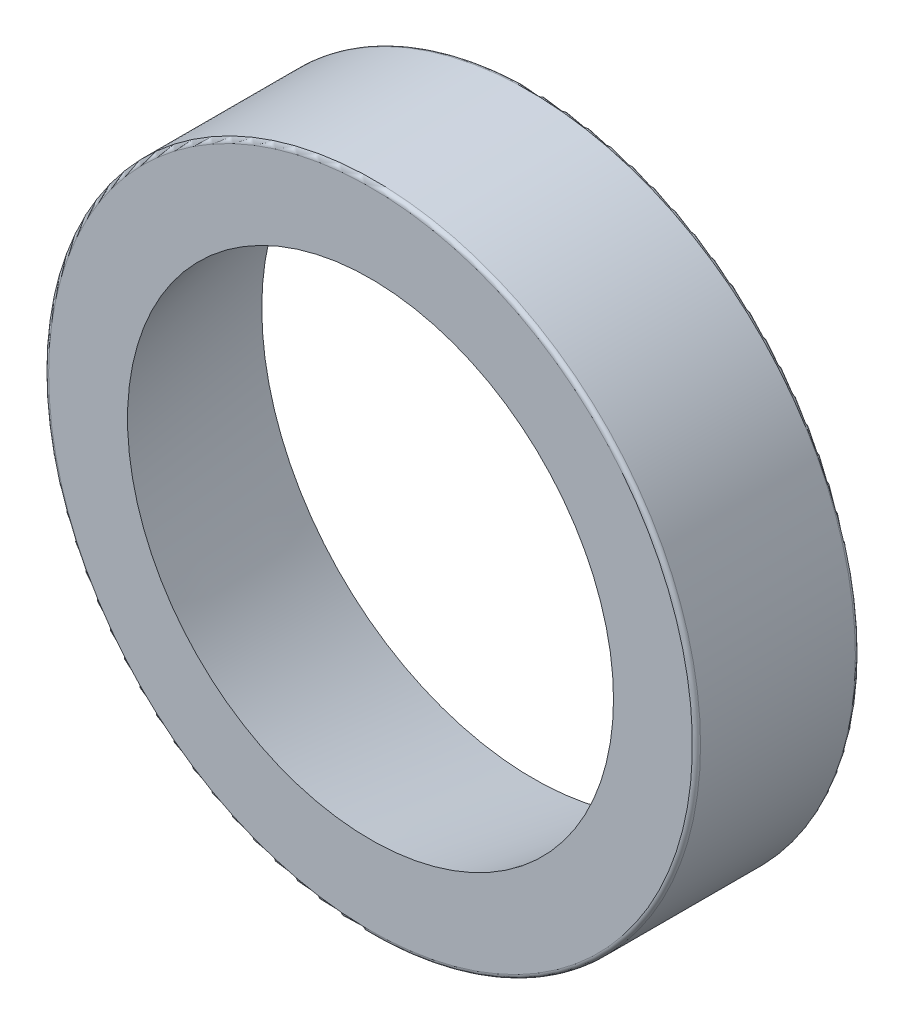
ISO-10303-21;
HEADER;
FILE_DESCRIPTION(('STEP AP214'),'2;1');
FILE_NAME('part.step','',(''),(''),'','','');
FILE_SCHEMA(('AUTOMOTIVE_DESIGN { 1 0 10303 214 1 1 1 1 }'));
ENDSEC;
DATA;
#1=APPLICATION_CONTEXT('core data for automotive mechanical design processes');
#2=APPLICATION_PROTOCOL_DEFINITION('international standard','automotive_design',2000,#1);
#3=PRODUCT_CONTEXT('',#1,'mechanical');
#4=PRODUCT('Part','Part','',(#3));
#5=PRODUCT_RELATED_PRODUCT_CATEGORY('part','',(#4));
#6=PRODUCT_DEFINITION_FORMATION('','',#4);
#7=PRODUCT_DEFINITION_CONTEXT('part definition',#1,'design');
#8=PRODUCT_DEFINITION('design','',#6,#7);
#9=PRODUCT_DEFINITION_SHAPE('','',#8);
#10=(LENGTH_UNIT() NAMED_UNIT(*) SI_UNIT(.MILLI.,.METRE.));
#11=(NAMED_UNIT(*) PLANE_ANGLE_UNIT() SI_UNIT($,.RADIAN.));
#12=(NAMED_UNIT(*) SI_UNIT($,.STERADIAN.) SOLID_ANGLE_UNIT());
#13=UNCERTAINTY_MEASURE_WITH_UNIT(LENGTH_MEASURE(1.E-05),#10,'distance_accuracy_value','');
#14=(GEOMETRIC_REPRESENTATION_CONTEXT(3) GLOBAL_UNCERTAINTY_ASSIGNED_CONTEXT((#13)) GLOBAL_UNIT_ASSIGNED_CONTEXT((#10,
#11,#12)) REPRESENTATION_CONTEXT('',''));
#15=CARTESIAN_POINT('',(0.,0.,0.));
#16=DIRECTION('',(0.,0.,1.));
#17=DIRECTION('',(1.,0.,0.));
#18=AXIS2_PLACEMENT_3D('',#15,#16,#17);
#19=CARTESIAN_POINT('',(0.,17.4625,-3.175));
#20=DIRECTION('',(0.,0.,1.));
#21=DIRECTION('',(1.,0.,0.));
#22=AXIS2_PLACEMENT_3D('',#19,#20,#21);
#23=PLANE('',#22);
#24=CARTESIAN_POINT('',(0.,0.,-3.175));
#25=DIRECTION('',(0.,0.,-1.));
#26=DIRECTION('',(1.,0.,0.));
#27=AXIS2_PLACEMENT_3D('',#24,#25,#26);
#28=CIRCLE('',#27,17.24421875);
#29=CARTESIAN_POINT('',(17.24421875,0.,-3.175));
#30=VERTEX_POINT('',#29);
#31=EDGE_CURVE('E10',#30,#30,#28,.T.);
#32=ORIENTED_EDGE('',*,*,#31,.T.);
#33=EDGE_LOOP('',(#32));
#34=FACE_BOUND('',#33,.T.);
#35=CARTESIAN_POINT('',(0.,0.,-3.175));
#36=DIRECTION('',(0.,0.,1.));
#37=DIRECTION('',(1.,0.,0.));
#38=AXIS2_PLACEMENT_3D('',#35,#36,#37);
#39=CIRCLE('',#38,14.5570549503108);
#40=CARTESIAN_POINT('',(14.5570549503108,0.,-3.175));
#41=VERTEX_POINT('',#40);
#42=EDGE_CURVE('E23',#41,#41,#39,.T.);
#43=ORIENTED_EDGE('',*,*,#42,.T.);
#44=EDGE_LOOP('',(#43));
#45=FACE_BOUND('',#44,.T.);
#46=ADVANCED_FACE('F15',(#34,#45),#23,.F.);
#47=CARTESIAN_POINT('',(0.,0.,5.55625));
#48=DIRECTION('',(0.,0.,-1.));
#49=DIRECTION('',(-1.,0.,0.));
#50=AXIS2_PLACEMENT_3D('',#47,#48,#49);
#51=CONICAL_SURFACE('',#50,13.0175,0.17453292519943);
#52=ORIENTED_EDGE('',*,*,#42,.F.);
#53=EDGE_LOOP('',(#52));
#54=FACE_BOUND('',#53,.T.);
#55=CARTESIAN_POINT('',(0.,0.,5.55625));
#56=DIRECTION('',(0.,0.,1.));
#57=DIRECTION('',(1.,0.,0.));
#58=AXIS2_PLACEMENT_3D('',#55,#56,#57);
#59=CIRCLE('',#58,13.0175);
#60=CARTESIAN_POINT('',(13.0175,0.,5.55625));
#61=VERTEX_POINT('',#60);
#62=EDGE_CURVE('E28',#61,#61,#59,.T.);
#63=ORIENTED_EDGE('',*,*,#62,.T.);
#64=EDGE_LOOP('',(#63));
#65=FACE_BOUND('',#64,.T.);
#66=ADVANCED_FACE('F55',(#54,#65),#51,.F.);
#67=CARTESIAN_POINT('',(0.,0.,-2.95671875));
#68=DIRECTION('',(0.,0.,1.));
#69=DIRECTION('',(1.,0.,0.));
#70=AXIS2_PLACEMENT_3D('',#67,#68,#69);
#71=TOROIDAL_SURFACE('',#70,17.24421875,0.21828125);
#72=ORIENTED_EDGE('',*,*,#31,.F.);
#73=EDGE_LOOP('',(#72));
#74=FACE_BOUND('',#73,.T.);
#75=CARTESIAN_POINT('',(0.,0.,-2.95671875));
#76=DIRECTION('',(0.,0.,1.));
#77=DIRECTION('',(1.,0.,0.));
#78=AXIS2_PLACEMENT_3D('',#75,#76,#77);
#79=CIRCLE('',#78,17.4625);
#80=CARTESIAN_POINT('',(17.4625,0.,-2.95671875));
#81=VERTEX_POINT('',#80);
#82=EDGE_CURVE('E33',#81,#81,#79,.T.);
#83=ORIENTED_EDGE('',*,*,#82,.F.);
#84=EDGE_LOOP('',(#83));
#85=FACE_BOUND('',#84,.T.);
#86=ADVANCED_FACE('F47',(#74,#85),#71,.T.);
#87=CARTESIAN_POINT('',(0.,0.,5.33796875));
#88=DIRECTION('',(0.,0.,-1.));
#89=DIRECTION('',(-1.,0.,0.));
#90=AXIS2_PLACEMENT_3D('',#87,#88,#89);
#91=TOROIDAL_SURFACE('',#90,17.24421875,0.21828125);
#92=CARTESIAN_POINT('',(0.,0.,5.55625));
#93=DIRECTION('',(0.,0.,1.));
#94=DIRECTION('',(-1.,0.,0.));
#95=AXIS2_PLACEMENT_3D('',#92,#93,#94);
#96=CIRCLE('',#95,17.24421875);
#97=CARTESIAN_POINT('',(-17.24421875,0.,5.55625));
#98=VERTEX_POINT('',#97);
#99=EDGE_CURVE('E35',#98,#98,#96,.T.);
#100=ORIENTED_EDGE('',*,*,#99,.F.);
#101=EDGE_LOOP('',(#100));
#102=FACE_BOUND('',#101,.T.);
#103=CARTESIAN_POINT('',(0.,0.,5.33796875));
#104=DIRECTION('',(0.,0.,-1.));
#105=DIRECTION('',(-1.,0.,0.));
#106=AXIS2_PLACEMENT_3D('',#103,#104,#105);
#107=CIRCLE('',#106,17.4625);
#108=CARTESIAN_POINT('',(-17.4625,0.,5.33796875));
#109=VERTEX_POINT('',#108);
#110=EDGE_CURVE('E19',#109,#109,#107,.T.);
#111=ORIENTED_EDGE('',*,*,#110,.F.);
#112=EDGE_LOOP('',(#111));
#113=FACE_BOUND('',#112,.T.);
#114=ADVANCED_FACE('F45',(#102,#113),#91,.T.);
#115=CARTESIAN_POINT('',(0.,0.,5.55625));
#116=DIRECTION('',(0.,0.,1.));
#117=DIRECTION('',(1.,0.,0.));
#118=AXIS2_PLACEMENT_3D('',#115,#116,#117);
#119=CYLINDRICAL_SURFACE('',#118,17.4625);
#120=ORIENTED_EDGE('',*,*,#110,.T.);
#121=EDGE_LOOP('',(#120));
#122=FACE_BOUND('',#121,.T.);
#123=ORIENTED_EDGE('',*,*,#82,.T.);
#124=EDGE_LOOP('',(#123));
#125=FACE_BOUND('',#124,.T.);
#126=ADVANCED_FACE('F42',(#122,#125),#119,.T.);
#127=CARTESIAN_POINT('',(0.,13.0175,5.55625));
#128=DIRECTION('',(0.,0.,-1.));
#129=DIRECTION('',(-1.,0.,0.));
#130=AXIS2_PLACEMENT_3D('',#127,#128,#129);
#131=PLANE('',#130);
#132=ORIENTED_EDGE('',*,*,#99,.T.);
#133=EDGE_LOOP('',(#132));
#134=FACE_BOUND('',#133,.T.);
#135=ORIENTED_EDGE('',*,*,#62,.F.);
#136=EDGE_LOOP('',(#135));
#137=FACE_BOUND('',#136,.T.);
#138=ADVANCED_FACE('F17',(#134,#137),#131,.F.);
#139=CLOSED_SHELL('',(#46,#66,#86,#114,#126,#138));
#140=MANIFOLD_SOLID_BREP('B1',#139);
#141=ADVANCED_BREP_SHAPE_REPRESENTATION('',(#18,#140),#14);
#142=SHAPE_DEFINITION_REPRESENTATION(#9,#141);
ENDSEC;
END-ISO-10303-21;
